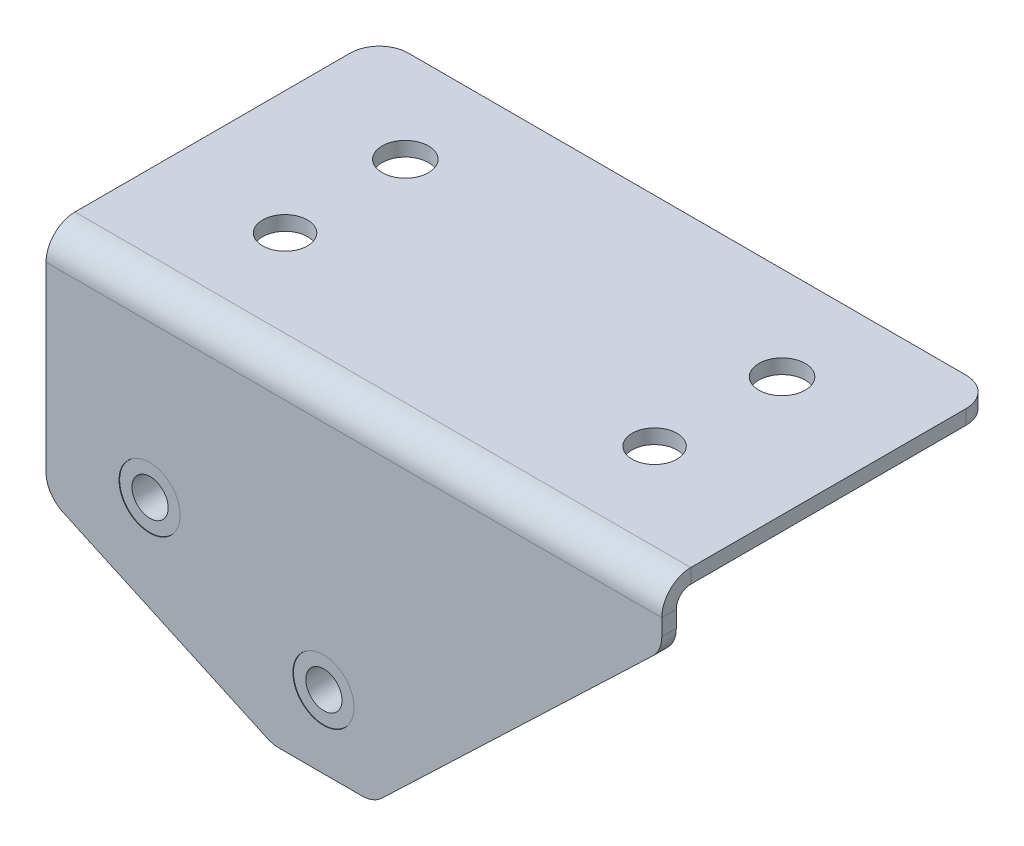
ISO-10303-21;
HEADER;
FILE_DESCRIPTION(('STEP AP214'),'2;1');
FILE_NAME('part.step','',(''),(''),'','','');
FILE_SCHEMA(('AUTOMOTIVE_DESIGN { 1 0 10303 214 1 1 1 1 }'));
ENDSEC;
DATA;
#1=APPLICATION_CONTEXT('core data for automotive mechanical design processes');
#2=APPLICATION_PROTOCOL_DEFINITION('international standard','automotive_design',2000,#1);
#3=PRODUCT_CONTEXT('',#1,'mechanical');
#4=PRODUCT('Part','Part','',(#3));
#5=PRODUCT_RELATED_PRODUCT_CATEGORY('part','',(#4));
#6=PRODUCT_DEFINITION_FORMATION('','',#4);
#7=PRODUCT_DEFINITION_CONTEXT('part definition',#1,'design');
#8=PRODUCT_DEFINITION('design','',#6,#7);
#9=PRODUCT_DEFINITION_SHAPE('','',#8);
#10=(LENGTH_UNIT() NAMED_UNIT(*) SI_UNIT(.MILLI.,.METRE.));
#11=(NAMED_UNIT(*) PLANE_ANGLE_UNIT() SI_UNIT($,.RADIAN.));
#12=(NAMED_UNIT(*) SI_UNIT($,.STERADIAN.) SOLID_ANGLE_UNIT());
#13=UNCERTAINTY_MEASURE_WITH_UNIT(LENGTH_MEASURE(1.E-05),#10,'distance_accuracy_value','');
#14=(GEOMETRIC_REPRESENTATION_CONTEXT(3) GLOBAL_UNCERTAINTY_ASSIGNED_CONTEXT((#13)) GLOBAL_UNIT_ASSIGNED_CONTEXT((#10,
#11,#12)) REPRESENTATION_CONTEXT('',''));
#15=CARTESIAN_POINT('',(0.,0.,0.));
#16=DIRECTION('',(0.,0.,1.));
#17=DIRECTION('',(1.,0.,0.));
#18=AXIS2_PLACEMENT_3D('',#15,#16,#17);
#19=CARTESIAN_POINT('',(7.14999999999999,10.5,-2.5));
#20=DIRECTION('',(0.,0.,1.));
#21=DIRECTION('',(1.,0.,0.));
#22=AXIS2_PLACEMENT_3D('',#19,#20,#21);
#23=PLANE('',#22);
#24=CARTESIAN_POINT('',(7.14999999999999,10.5,-2.5));
#25=DIRECTION('',(0.,0.,-1.));
#26=DIRECTION('',(0.,1.,0.));
#27=AXIS2_PLACEMENT_3D('',#24,#25,#26);
#28=CIRCLE('',#27,1.24999999999999);
#29=CARTESIAN_POINT('',(7.14999999999999,11.75,-2.5));
#30=VERTEX_POINT('',#29);
#31=EDGE_CURVE('E70',#30,#30,#28,.T.);
#32=ORIENTED_EDGE('',*,*,#31,.F.);
#33=EDGE_LOOP('',(#32));
#34=FACE_BOUND('',#33,.T.);
#35=CARTESIAN_POINT('',(7.14999999999999,10.5,-2.5));
#36=DIRECTION('',(0.,0.,-1.));
#37=DIRECTION('',(-1.,0.,0.));
#38=AXIS2_PLACEMENT_3D('',#35,#36,#37);
#39=CIRCLE('',#38,3.15);
#40=CARTESIAN_POINT('',(3.99999999999999,10.5,-2.5));
#41=VERTEX_POINT('',#40);
#42=EDGE_CURVE('E11',#41,#41,#39,.T.);
#43=ORIENTED_EDGE('',*,*,#42,.T.);
#44=EDGE_LOOP('',(#43));
#45=FACE_BOUND('',#44,.T.);
#46=ADVANCED_FACE('F48',(#34,#45),#23,.F.);
#47=CARTESIAN_POINT('',(7.14999999999999,10.5,-2.5));
#48=DIRECTION('',(0.,0.,-1.));
#49=DIRECTION('',(-1.,0.,0.));
#50=AXIS2_PLACEMENT_3D('',#47,#48,#49);
#51=CYLINDRICAL_SURFACE('',#50,3.15);
#52=ORIENTED_EDGE('',*,*,#42,.F.);
#53=EDGE_LOOP('',(#52));
#54=FACE_BOUND('',#53,.T.);
#55=CARTESIAN_POINT('',(7.14999999999999,10.5,-1.));
#56=DIRECTION('',(0.,0.,-1.));
#57=DIRECTION('',(-1.,0.,0.));
#58=AXIS2_PLACEMENT_3D('',#55,#56,#57);
#59=CIRCLE('',#58,3.15);
#60=CARTESIAN_POINT('',(3.99999999999999,10.5,-1.));
#61=VERTEX_POINT('',#60);
#62=EDGE_CURVE('E54',#61,#61,#59,.T.);
#63=ORIENTED_EDGE('',*,*,#62,.T.);
#64=EDGE_LOOP('',(#63));
#65=FACE_BOUND('',#64,.T.);
#66=ADVANCED_FACE('F78',(#54,#65),#51,.T.);
#67=CARTESIAN_POINT('',(10.3,10.5,-1.));
#68=DIRECTION('',(0.,0.,-1.));
#69=DIRECTION('',(-1.,0.,0.));
#70=AXIS2_PLACEMENT_3D('',#67,#68,#69);
#71=PLANE('',#70);
#72=ORIENTED_EDGE('',*,*,#62,.F.);
#73=EDGE_LOOP('',(#72));
#74=FACE_BOUND('',#73,.T.);
#75=CARTESIAN_POINT('',(7.14999999999999,10.5,-1.));
#76=DIRECTION('',(0.,0.,-1.));
#77=DIRECTION('',(-1.,0.,0.));
#78=AXIS2_PLACEMENT_3D('',#75,#76,#77);
#79=CIRCLE('',#78,2.1);
#80=CARTESIAN_POINT('',(5.04999999999998,10.5,-1.));
#81=VERTEX_POINT('',#80);
#82=EDGE_CURVE('E58',#81,#81,#79,.T.);
#83=ORIENTED_EDGE('',*,*,#82,.T.);
#84=EDGE_LOOP('',(#83));
#85=FACE_BOUND('',#84,.T.);
#86=ADVANCED_FACE('F82',(#74,#85),#71,.F.);
#87=CARTESIAN_POINT('',(7.14999999999999,10.5,-2.5));
#88=DIRECTION('',(0.,0.,-1.));
#89=DIRECTION('',(-1.,0.,0.));
#90=AXIS2_PLACEMENT_3D('',#87,#88,#89);
#91=CYLINDRICAL_SURFACE('',#90,2.1);
#92=ORIENTED_EDGE('',*,*,#82,.F.);
#93=EDGE_LOOP('',(#92));
#94=FACE_BOUND('',#93,.T.);
#95=CARTESIAN_POINT('',(7.14999999999999,10.5,-0.0300000000000014));
#96=DIRECTION('',(0.,0.,-1.));
#97=DIRECTION('',(-1.,0.,0.));
#98=AXIS2_PLACEMENT_3D('',#95,#96,#97);
#99=CIRCLE('',#98,2.1);
#100=CARTESIAN_POINT('',(5.04999999999998,10.5,-0.0300000000000014));
#101=VERTEX_POINT('',#100);
#102=EDGE_CURVE('E62',#101,#101,#99,.T.);
#103=ORIENTED_EDGE('',*,*,#102,.T.);
#104=EDGE_LOOP('',(#103));
#105=FACE_BOUND('',#104,.T.);
#106=ADVANCED_FACE('F87',(#94,#105),#91,.T.);
#107=CARTESIAN_POINT('',(9.24999999999999,10.5,-0.0300000000000014));
#108=DIRECTION('',(0.,0.,-1.));
#109=DIRECTION('',(-1.,0.,0.));
#110=AXIS2_PLACEMENT_3D('',#107,#108,#109);
#111=PLANE('',#110);
#112=CARTESIAN_POINT('',(7.14999999999999,10.5,-0.0300000000000014));
#113=DIRECTION('',(0.,0.,-1.));
#114=DIRECTION('',(-1.,0.,0.));
#115=AXIS2_PLACEMENT_3D('',#112,#113,#114);
#116=CIRCLE('',#115,1.24999999999999);
#117=CARTESIAN_POINT('',(5.9,10.5,-0.0300000000000014));
#118=VERTEX_POINT('',#117);
#119=EDGE_CURVE('E67',#118,#118,#116,.T.);
#120=ORIENTED_EDGE('',*,*,#119,.T.);
#121=EDGE_LOOP('',(#120));
#122=FACE_BOUND('',#121,.T.);
#123=ORIENTED_EDGE('',*,*,#102,.F.);
#124=EDGE_LOOP('',(#123));
#125=FACE_BOUND('',#124,.T.);
#126=ADVANCED_FACE('F93',(#122,#125),#111,.F.);
#127=CARTESIAN_POINT('',(7.14999999999999,10.5,-2.5));
#128=DIRECTION('',(0.,0.,-1.));
#129=DIRECTION('',(0.,1.,0.));
#130=AXIS2_PLACEMENT_3D('',#127,#128,#129);
#131=CYLINDRICAL_SURFACE('',#130,1.24999999999999);
#132=ORIENTED_EDGE('',*,*,#31,.T.);
#133=EDGE_LOOP('',(#132));
#134=FACE_BOUND('',#133,.T.);
#135=ORIENTED_EDGE('',*,*,#119,.F.);
#136=EDGE_LOOP('',(#135));
#137=FACE_BOUND('',#136,.T.);
#138=ADVANCED_FACE('F74',(#134,#137),#131,.F.);
#139=CLOSED_SHELL('',(#46,#66,#86,#106,#126,#138));
#140=MANIFOLD_SOLID_BREP('B2',#139);
#141=CARTESIAN_POINT('',(19.15,5.,-2.5));
#142=DIRECTION('',(0.,0.,1.));
#143=DIRECTION('',(1.,0.,0.));
#144=AXIS2_PLACEMENT_3D('',#141,#142,#143);
#145=PLANE('',#144);
#146=CARTESIAN_POINT('',(19.15,5.,-2.5));
#147=DIRECTION('',(0.,0.,-1.));
#148=DIRECTION('',(0.,1.,0.));
#149=AXIS2_PLACEMENT_3D('',#146,#147,#148);
#150=CIRCLE('',#149,1.24999999999999);
#151=CARTESIAN_POINT('',(19.15,6.24999999999999,-2.5));
#152=VERTEX_POINT('',#151);
#153=EDGE_CURVE('E185',#152,#152,#150,.T.);
#154=ORIENTED_EDGE('',*,*,#153,.F.);
#155=EDGE_LOOP('',(#154));
#156=FACE_BOUND('',#155,.T.);
#157=CARTESIAN_POINT('',(19.15,5.,-2.5));
#158=DIRECTION('',(0.,0.,-1.));
#159=DIRECTION('',(-1.,0.,0.));
#160=AXIS2_PLACEMENT_3D('',#157,#158,#159);
#161=CIRCLE('',#160,3.15);
#162=CARTESIAN_POINT('',(16.,5.,-2.5));
#163=VERTEX_POINT('',#162);
#164=EDGE_CURVE('E47',#163,#163,#161,.T.);
#165=ORIENTED_EDGE('',*,*,#164,.T.);
#166=EDGE_LOOP('',(#165));
#167=FACE_BOUND('',#166,.T.);
#168=ADVANCED_FACE('F163',(#156,#167),#145,.F.);
#169=CARTESIAN_POINT('',(19.15,5.,-2.5));
#170=DIRECTION('',(0.,0.,-1.));
#171=DIRECTION('',(-1.,0.,0.));
#172=AXIS2_PLACEMENT_3D('',#169,#170,#171);
#173=CYLINDRICAL_SURFACE('',#172,3.15);
#174=ORIENTED_EDGE('',*,*,#164,.F.);
#175=EDGE_LOOP('',(#174));
#176=FACE_BOUND('',#175,.T.);
#177=CARTESIAN_POINT('',(19.15,5.,-1.));
#178=DIRECTION('',(0.,0.,-1.));
#179=DIRECTION('',(-1.,0.,0.));
#180=AXIS2_PLACEMENT_3D('',#177,#178,#179);
#181=CIRCLE('',#180,3.15);
#182=CARTESIAN_POINT('',(16.,5.,-1.));
#183=VERTEX_POINT('',#182);
#184=EDGE_CURVE('E169',#183,#183,#181,.T.);
#185=ORIENTED_EDGE('',*,*,#184,.T.);
#186=EDGE_LOOP('',(#185));
#187=FACE_BOUND('',#186,.T.);
#188=ADVANCED_FACE('F193',(#176,#187),#173,.T.);
#189=CARTESIAN_POINT('',(22.3,5.,-1.));
#190=DIRECTION('',(0.,0.,-1.));
#191=DIRECTION('',(-1.,0.,0.));
#192=AXIS2_PLACEMENT_3D('',#189,#190,#191);
#193=PLANE('',#192);
#194=ORIENTED_EDGE('',*,*,#184,.F.);
#195=EDGE_LOOP('',(#194));
#196=FACE_BOUND('',#195,.T.);
#197=CARTESIAN_POINT('',(19.15,5.,-1.));
#198=DIRECTION('',(0.,0.,-1.));
#199=DIRECTION('',(-1.,0.,0.));
#200=AXIS2_PLACEMENT_3D('',#197,#198,#199);
#201=CIRCLE('',#200,2.1);
#202=CARTESIAN_POINT('',(17.05,5.,-1.));
#203=VERTEX_POINT('',#202);
#204=EDGE_CURVE('E173',#203,#203,#201,.T.);
#205=ORIENTED_EDGE('',*,*,#204,.T.);
#206=EDGE_LOOP('',(#205));
#207=FACE_BOUND('',#206,.T.);
#208=ADVANCED_FACE('F197',(#196,#207),#193,.F.);
#209=CARTESIAN_POINT('',(19.15,5.,-2.5));
#210=DIRECTION('',(0.,0.,-1.));
#211=DIRECTION('',(-1.,0.,0.));
#212=AXIS2_PLACEMENT_3D('',#209,#210,#211);
#213=CYLINDRICAL_SURFACE('',#212,2.1);
#214=ORIENTED_EDGE('',*,*,#204,.F.);
#215=EDGE_LOOP('',(#214));
#216=FACE_BOUND('',#215,.T.);
#217=CARTESIAN_POINT('',(19.15,5.,-0.0300000000000018));
#218=DIRECTION('',(0.,0.,-1.));
#219=DIRECTION('',(-1.,0.,0.));
#220=AXIS2_PLACEMENT_3D('',#217,#218,#219);
#221=CIRCLE('',#220,2.1);
#222=CARTESIAN_POINT('',(17.05,5.,-0.0300000000000018));
#223=VERTEX_POINT('',#222);
#224=EDGE_CURVE('E177',#223,#223,#221,.T.);
#225=ORIENTED_EDGE('',*,*,#224,.T.);
#226=EDGE_LOOP('',(#225));
#227=FACE_BOUND('',#226,.T.);
#228=ADVANCED_FACE('F202',(#216,#227),#213,.T.);
#229=CARTESIAN_POINT('',(21.25,5.,-0.0300000000000016));
#230=DIRECTION('',(0.,0.,-1.));
#231=DIRECTION('',(-1.,0.,0.));
#232=AXIS2_PLACEMENT_3D('',#229,#230,#231);
#233=PLANE('',#232);
#234=CARTESIAN_POINT('',(19.15,5.,-0.0300000000000018));
#235=DIRECTION('',(0.,0.,-1.));
#236=DIRECTION('',(-1.,0.,0.));
#237=AXIS2_PLACEMENT_3D('',#234,#235,#236);
#238=CIRCLE('',#237,1.24999999999999);
#239=CARTESIAN_POINT('',(17.9,5.,-0.0300000000000018));
#240=VERTEX_POINT('',#239);
#241=EDGE_CURVE('E182',#240,#240,#238,.T.);
#242=ORIENTED_EDGE('',*,*,#241,.T.);
#243=EDGE_LOOP('',(#242));
#244=FACE_BOUND('',#243,.T.);
#245=ORIENTED_EDGE('',*,*,#224,.F.);
#246=EDGE_LOOP('',(#245));
#247=FACE_BOUND('',#246,.T.);
#248=ADVANCED_FACE('F208',(#244,#247),#233,.F.);
#249=CARTESIAN_POINT('',(19.15,5.,-2.5));
#250=DIRECTION('',(0.,0.,-1.));
#251=DIRECTION('',(0.,1.,0.));
#252=AXIS2_PLACEMENT_3D('',#249,#250,#251);
#253=CYLINDRICAL_SURFACE('',#252,1.24999999999999);
#254=ORIENTED_EDGE('',*,*,#153,.T.);
#255=EDGE_LOOP('',(#254));
#256=FACE_BOUND('',#255,.T.);
#257=ORIENTED_EDGE('',*,*,#241,.F.);
#258=EDGE_LOOP('',(#257));
#259=FACE_BOUND('',#258,.T.);
#260=ADVANCED_FACE('F189',(#256,#259),#253,.F.);
#261=CLOSED_SHELL('',(#168,#188,#208,#228,#248,#260));
#262=MANIFOLD_SOLID_BREP('B6',#261);
#263=CARTESIAN_POINT('',(0.,0.,-1.));
#264=DIRECTION('',(0.,0.,-1.));
#265=DIRECTION('',(-1.,0.,0.));
#266=AXIS2_PLACEMENT_3D('',#263,#264,#265);
#267=PLANE('',#266);
#268=CARTESIAN_POINT('',(19.15,5.,-1.));
#269=DIRECTION('',(0.,0.,1.));
#270=DIRECTION('',(1.,0.,0.));
#271=AXIS2_PLACEMENT_3D('',#268,#269,#270);
#272=CIRCLE('',#271,2.11);
#273=CARTESIAN_POINT('',(21.26,5.,-1.));
#274=VERTEX_POINT('',#273);
#275=EDGE_CURVE('E528',#274,#274,#272,.T.);
#276=ORIENTED_EDGE('',*,*,#275,.T.);
#277=EDGE_LOOP('',(#276));
#278=FACE_BOUND('',#277,.T.);
#279=CARTESIAN_POINT('',(7.14999999999999,10.5,-1.));
#280=DIRECTION('',(0.,0.,1.));
#281=DIRECTION('',(1.,0.,0.));
#282=AXIS2_PLACEMENT_3D('',#279,#280,#281);
#283=CIRCLE('',#282,2.11);
#284=CARTESIAN_POINT('',(9.25999999999999,10.5,-1.));
#285=VERTEX_POINT('',#284);
#286=EDGE_CURVE('E523',#285,#285,#283,.T.);
#287=ORIENTED_EDGE('',*,*,#286,.T.);
#288=EDGE_LOOP('',(#287));
#289=FACE_BOUND('',#288,.T.);
#290=DIRECTION('',(0.,1.,0.));
#291=VECTOR('',#290,1.);
#292=CARTESIAN_POINT('',(42.5,0.,-1.));
#293=LINE('',#292,#291);
#294=CARTESIAN_POINT('',(42.5,19.8556065200386,-1.));
#295=VERTEX_POINT('',#294);
#296=CARTESIAN_POINT('',(42.5,21.,-1.));
#297=VERTEX_POINT('',#296);
#298=EDGE_CURVE('E448',#295,#297,#293,.T.);
#299=ORIENTED_EDGE('',*,*,#298,.F.);
#300=CARTESIAN_POINT('',(40.5,19.8556065200386,-1.));
#301=DIRECTION('',(0.,0.,-1.));
#302=DIRECTION('',(-1.,0.,0.));
#303=AXIS2_PLACEMENT_3D('',#300,#301,#302);
#304=CIRCLE('',#303,2.);
#305=CARTESIAN_POINT('',(41.8811894796554,18.4091226378991,-1.));
#306=VERTEX_POINT('',#305);
#307=EDGE_CURVE('E477',#295,#306,#304,.T.);
#308=ORIENTED_EDGE('',*,*,#307,.T.);
#309=DIRECTION('',(0.723241941069744,0.690594739827686,0.));
#310=VECTOR('',#309,1.);
#311=CARTESIAN_POINT('',(10.7792720014158,-11.2888517042107,-1.));
#312=LINE('',#311,#310);
#313=CARTESIAN_POINT('',(23.1814763573797,0.553516117860515,-1.));
#314=VERTEX_POINT('',#313);
#315=EDGE_CURVE('E537',#314,#306,#312,.T.);
#316=ORIENTED_EDGE('',*,*,#315,.F.);
#317=CARTESIAN_POINT('',(21.8002868777243,2.,-1.));
#318=DIRECTION('',(0.,0.,-1.));
#319=DIRECTION('',(-1.,0.,0.));
#320=AXIS2_PLACEMENT_3D('',#317,#318,#319);
#321=CIRCLE('',#320,2.);
#322=CARTESIAN_POINT('',(21.8002868777243,0.,-1.));
#323=VERTEX_POINT('',#322);
#324=EDGE_CURVE('E475',#314,#323,#321,.T.);
#325=ORIENTED_EDGE('',*,*,#324,.T.);
#326=DIRECTION('',(1.,0.,0.));
#327=VECTOR('',#326,1.);
#328=CARTESIAN_POINT('',(0.,0.,-1.));
#329=LINE('',#328,#327);
#330=CARTESIAN_POINT('',(16.0951790673134,0.,-1.));
#331=VERTEX_POINT('',#330);
#332=EDGE_CURVE('E444',#331,#323,#329,.T.);
#333=ORIENTED_EDGE('',*,*,#332,.F.);
#334=CARTESIAN_POINT('',(16.0951790673134,2.,-1.));
#335=DIRECTION('',(0.,0.,-1.));
#336=DIRECTION('',(-1.,0.,0.));
#337=AXIS2_PLACEMENT_3D('',#334,#335,#336);
#338=CIRCLE('',#337,2.);
#339=CARTESIAN_POINT('',(15.261869646327,0.18187035421143,-1.));
#340=VERTEX_POINT('',#339);
#341=EDGE_CURVE('E473',#331,#340,#338,.T.);
#342=ORIENTED_EDGE('',*,*,#341,.T.);
#343=DIRECTION('',(0.909064822894284,-0.416654710493214,0.));
#344=VECTOR('',#343,1.);
#345=CARTESIAN_POINT('',(2.71836441996754,5.93097691629283,-1.));
#346=LINE('',#345,#344);
#347=CARTESIAN_POINT('',(1.16669057901357,6.6421607600634,-1.));
#348=VERTEX_POINT('',#347);
#349=EDGE_CURVE('E543',#348,#340,#346,.T.);
#350=ORIENTED_EDGE('',*,*,#349,.F.);
#351=CARTESIAN_POINT('',(1.99999999999999,8.46029040585197,-1.));
#352=DIRECTION('',(0.,0.,-1.));
#353=DIRECTION('',(-1.,0.,0.));
#354=AXIS2_PLACEMENT_3D('',#351,#352,#353);
#355=CIRCLE('',#354,2.);
#356=CARTESIAN_POINT('',(0.,8.46029040585197,-1.));
#357=VERTEX_POINT('',#356);
#358=EDGE_CURVE('E471',#348,#357,#355,.T.);
#359=ORIENTED_EDGE('',*,*,#358,.T.);
#360=DIRECTION('',(0.,-1.,0.));
#361=VECTOR('',#360,1.);
#362=CARTESIAN_POINT('',(0.,0.,-1.));
#363=LINE('',#362,#361);
#364=CARTESIAN_POINT('',(0.,21.,-1.));
#365=VERTEX_POINT('',#364);
#366=EDGE_CURVE('E441',#365,#357,#363,.T.);
#367=ORIENTED_EDGE('',*,*,#366,.F.);
#368=DIRECTION('',(1.,0.,0.));
#369=VECTOR('',#368,1.);
#370=CARTESIAN_POINT('',(42.5,21.,-1.));
#371=LINE('',#370,#369);
#372=EDGE_CURVE('E431',#297,#365,#371,.F.);
#373=ORIENTED_EDGE('',*,*,#372,.F.);
#374=EDGE_LOOP('',(#299,#308,#316,#325,#333,#342,#350,#359,#367,#373));
#375=FACE_BOUND('',#374,.T.);
#376=ADVANCED_FACE('F268',(#278,#289,#375),#267,.T.);
#377=CARTESIAN_POINT('',(0.,0.,0.));
#378=DIRECTION('',(0.,0.,-1.));
#379=DIRECTION('',(-1.,0.,0.));
#380=AXIS2_PLACEMENT_3D('',#377,#378,#379);
#381=PLANE('',#380);
#382=CARTESIAN_POINT('',(19.15,5.,0.));
#383=DIRECTION('',(0.,0.,1.));
#384=DIRECTION('',(1.,0.,0.));
#385=AXIS2_PLACEMENT_3D('',#382,#383,#384);
#386=CIRCLE('',#385,2.11);
#387=CARTESIAN_POINT('',(21.26,5.,0.));
#388=VERTEX_POINT('',#387);
#389=EDGE_CURVE('E531',#388,#388,#386,.T.);
#390=ORIENTED_EDGE('',*,*,#389,.F.);
#391=EDGE_LOOP('',(#390));
#392=FACE_BOUND('',#391,.T.);
#393=CARTESIAN_POINT('',(7.14999999999999,10.5,0.));
#394=DIRECTION('',(0.,0.,1.));
#395=DIRECTION('',(1.,0.,0.));
#396=AXIS2_PLACEMENT_3D('',#393,#394,#395);
#397=CIRCLE('',#396,2.11);
#398=CARTESIAN_POINT('',(9.25999999999999,10.5,0.));
#399=VERTEX_POINT('',#398);
#400=EDGE_CURVE('E525',#399,#399,#397,.T.);
#401=ORIENTED_EDGE('',*,*,#400,.F.);
#402=EDGE_LOOP('',(#401));
#403=FACE_BOUND('',#402,.T.);
#404=DIRECTION('',(0.723241941069744,0.690594739827686,0.));
#405=VECTOR('',#404,1.);
#406=CARTESIAN_POINT('',(10.7792720014158,-11.2888517042107,0.));
#407=LINE('',#406,#405);
#408=CARTESIAN_POINT('',(23.1814763573797,0.553516117860515,0.));
#409=VERTEX_POINT('',#408);
#410=CARTESIAN_POINT('',(41.8811894796554,18.4091226378991,0.));
#411=VERTEX_POINT('',#410);
#412=EDGE_CURVE('E534',#409,#411,#407,.T.);
#413=ORIENTED_EDGE('',*,*,#412,.T.);
#414=CARTESIAN_POINT('',(40.5,19.8556065200386,0.));
#415=DIRECTION('',(0.,0.,-1.));
#416=DIRECTION('',(-1.,0.,0.));
#417=AXIS2_PLACEMENT_3D('',#414,#415,#416);
#418=CIRCLE('',#417,2.);
#419=CARTESIAN_POINT('',(42.5,19.8556065200386,0.));
#420=VERTEX_POINT('',#419);
#421=EDGE_CURVE('E467',#411,#420,#418,.F.);
#422=ORIENTED_EDGE('',*,*,#421,.T.);
#423=DIRECTION('',(0.,1.,0.));
#424=VECTOR('',#423,1.);
#425=CARTESIAN_POINT('',(42.5,0.,0.));
#426=LINE('',#425,#424);
#427=CARTESIAN_POINT('',(42.5,21.,0.));
#428=VERTEX_POINT('',#427);
#429=EDGE_CURVE('E445',#420,#428,#426,.T.);
#430=ORIENTED_EDGE('',*,*,#429,.T.);
#431=DIRECTION('',(1.,0.,0.));
#432=VECTOR('',#431,1.);
#433=CARTESIAN_POINT('',(42.5,21.,0.));
#434=LINE('',#433,#432);
#435=CARTESIAN_POINT('',(0.,21.,0.));
#436=VERTEX_POINT('',#435);
#437=EDGE_CURVE('E391',#428,#436,#434,.F.);
#438=ORIENTED_EDGE('',*,*,#437,.T.);
#439=DIRECTION('',(0.,-1.,0.));
#440=VECTOR('',#439,1.);
#441=CARTESIAN_POINT('',(0.,0.,0.));
#442=LINE('',#441,#440);
#443=CARTESIAN_POINT('',(0.,8.46029040585197,0.));
#444=VERTEX_POINT('',#443);
#445=EDGE_CURVE('E438',#436,#444,#442,.T.);
#446=ORIENTED_EDGE('',*,*,#445,.T.);
#447=CARTESIAN_POINT('',(1.99999999999999,8.46029040585197,0.));
#448=DIRECTION('',(0.,0.,-1.));
#449=DIRECTION('',(-1.,0.,0.));
#450=AXIS2_PLACEMENT_3D('',#447,#448,#449);
#451=CIRCLE('',#450,2.);
#452=CARTESIAN_POINT('',(1.16669057901357,6.6421607600634,0.));
#453=VERTEX_POINT('',#452);
#454=EDGE_CURVE('E461',#444,#453,#451,.F.);
#455=ORIENTED_EDGE('',*,*,#454,.T.);
#456=DIRECTION('',(0.909064822894284,-0.416654710493214,0.));
#457=VECTOR('',#456,1.);
#458=CARTESIAN_POINT('',(2.71836441996754,5.93097691629283,0.));
#459=LINE('',#458,#457);
#460=CARTESIAN_POINT('',(15.261869646327,0.18187035421143,0.));
#461=VERTEX_POINT('',#460);
#462=EDGE_CURVE('E540',#453,#461,#459,.T.);
#463=ORIENTED_EDGE('',*,*,#462,.T.);
#464=CARTESIAN_POINT('',(16.0951790673134,2.,0.));
#465=DIRECTION('',(0.,0.,-1.));
#466=DIRECTION('',(-1.,0.,0.));
#467=AXIS2_PLACEMENT_3D('',#464,#465,#466);
#468=CIRCLE('',#467,2.);
#469=CARTESIAN_POINT('',(16.0951790673134,0.,0.));
#470=VERTEX_POINT('',#469);
#471=EDGE_CURVE('E463',#461,#470,#468,.F.);
#472=ORIENTED_EDGE('',*,*,#471,.T.);
#473=DIRECTION('',(1.,0.,0.));
#474=VECTOR('',#473,1.);
#475=CARTESIAN_POINT('',(0.,0.,0.));
#476=LINE('',#475,#474);
#477=CARTESIAN_POINT('',(21.8002868777243,0.,0.));
#478=VERTEX_POINT('',#477);
#479=EDGE_CURVE('E453',#470,#478,#476,.T.);
#480=ORIENTED_EDGE('',*,*,#479,.T.);
#481=CARTESIAN_POINT('',(21.8002868777243,2.,0.));
#482=DIRECTION('',(0.,0.,-1.));
#483=DIRECTION('',(-1.,0.,0.));
#484=AXIS2_PLACEMENT_3D('',#481,#482,#483);
#485=CIRCLE('',#484,2.);
#486=EDGE_CURVE('E465',#478,#409,#485,.F.);
#487=ORIENTED_EDGE('',*,*,#486,.T.);
#488=EDGE_LOOP('',(#413,#422,#430,#438,#446,#455,#463,#472,#480,#487));
#489=FACE_BOUND('',#488,.T.);
#490=ADVANCED_FACE('F605',(#392,#403,#489),#381,.F.);
#491=CARTESIAN_POINT('',(0.,0.,-1.));
#492=DIRECTION('',(0.,-1.,0.));
#493=DIRECTION('',(0.,0.,-1.));
#494=AXIS2_PLACEMENT_3D('',#491,#492,#493);
#495=PLANE('',#494);
#496=ORIENTED_EDGE('',*,*,#332,.T.);
#497=DIRECTION('',(0.,0.,-1.));
#498=VECTOR('',#497,1.);
#499=CARTESIAN_POINT('',(21.8002868777243,0.,-1.));
#500=LINE('',#499,#498);
#501=EDGE_CURVE('E481',#323,#478,#500,.F.);
#502=ORIENTED_EDGE('',*,*,#501,.T.);
#503=ORIENTED_EDGE('',*,*,#479,.F.);
#504=DIRECTION('',(0.,0.,-1.));
#505=VECTOR('',#504,1.);
#506=CARTESIAN_POINT('',(16.0951790673134,0.,-1.));
#507=LINE('',#506,#505);
#508=EDGE_CURVE('E479',#470,#331,#507,.T.);
#509=ORIENTED_EDGE('',*,*,#508,.T.);
#510=EDGE_LOOP('',(#496,#502,#503,#509));
#511=FACE_BOUND('',#510,.T.);
#512=ADVANCED_FACE('F611',(#511),#495,.T.);
#513=CARTESIAN_POINT('',(0.,0.,-1.));
#514=DIRECTION('',(-1.,0.,0.));
#515=DIRECTION('',(0.,-1.,0.));
#516=AXIS2_PLACEMENT_3D('',#513,#514,#515);
#517=PLANE('',#516);
#518=ORIENTED_EDGE('',*,*,#366,.T.);
#519=DIRECTION('',(0.,0.,-1.));
#520=VECTOR('',#519,1.);
#521=CARTESIAN_POINT('',(0.,8.46029040585197,-1.));
#522=LINE('',#521,#520);
#523=EDGE_CURVE('E489',#357,#444,#522,.F.);
#524=ORIENTED_EDGE('',*,*,#523,.T.);
#525=ORIENTED_EDGE('',*,*,#445,.F.);
#526=DIRECTION('',(0.,0.,1.));
#527=VECTOR('',#526,1.);
#528=CARTESIAN_POINT('',(0.,21.,-1.));
#529=LINE('',#528,#527);
#530=EDGE_CURVE('E435',#365,#436,#529,.T.);
#531=ORIENTED_EDGE('',*,*,#530,.F.);
#532=EDGE_LOOP('',(#518,#524,#525,#531));
#533=FACE_BOUND('',#532,.T.);
#534=ADVANCED_FACE('F622',(#533),#517,.T.);
#535=CARTESIAN_POINT('',(42.5,0.,-1.));
#536=DIRECTION('',(1.,0.,0.));
#537=DIRECTION('',(0.,0.,-1.));
#538=AXIS2_PLACEMENT_3D('',#535,#536,#537);
#539=PLANE('',#538);
#540=ORIENTED_EDGE('',*,*,#429,.F.);
#541=DIRECTION('',(0.,0.,-1.));
#542=VECTOR('',#541,1.);
#543=CARTESIAN_POINT('',(42.5,19.8556065200386,-1.));
#544=LINE('',#543,#542);
#545=EDGE_CURVE('E469',#420,#295,#544,.T.);
#546=ORIENTED_EDGE('',*,*,#545,.T.);
#547=ORIENTED_EDGE('',*,*,#298,.T.);
#548=DIRECTION('',(0.,0.,1.));
#549=VECTOR('',#548,1.);
#550=CARTESIAN_POINT('',(42.5,21.,-1.));
#551=LINE('',#550,#549);
#552=EDGE_CURVE('E427',#297,#428,#551,.T.);
#553=ORIENTED_EDGE('',*,*,#552,.T.);
#554=EDGE_LOOP('',(#540,#546,#547,#553));
#555=FACE_BOUND('',#554,.T.);
#556=ADVANCED_FACE('F618',(#555),#539,.T.);
#557=CARTESIAN_POINT('',(0.,21.,-2.));
#558=DIRECTION('',(-1.,0.,0.));
#559=DIRECTION('',(0.,0.,1.));
#560=AXIS2_PLACEMENT_3D('',#557,#558,#559);
#561=PLANE('',#560);
#562=DIRECTION('',(0.,1.,0.));
#563=VECTOR('',#562,1.);
#564=CARTESIAN_POINT('',(0.,22.,-2.));
#565=LINE('',#564,#563);
#566=CARTESIAN_POINT('',(0.,22.,-2.));
#567=VERTEX_POINT('',#566);
#568=CARTESIAN_POINT('',(0.,23.,-1.99999999999999));
#569=VERTEX_POINT('',#568);
#570=EDGE_CURVE('E512',#567,#569,#565,.T.);
#571=ORIENTED_EDGE('',*,*,#570,.F.);
#572=CARTESIAN_POINT('',(0.,21.,-2.));
#573=DIRECTION('',(1.,0.,0.));
#574=DIRECTION('',(0.,0.,-1.));
#575=AXIS2_PLACEMENT_3D('',#572,#573,#574);
#576=CIRCLE('',#575,1.);
#577=EDGE_CURVE('E394',#365,#567,#576,.F.);
#578=ORIENTED_EDGE('',*,*,#577,.F.);
#579=ORIENTED_EDGE('',*,*,#530,.T.);
#580=CARTESIAN_POINT('',(0.,21.,-2.));
#581=DIRECTION('',(1.,0.,0.));
#582=DIRECTION('',(0.,0.,-1.));
#583=AXIS2_PLACEMENT_3D('',#580,#581,#582);
#584=CIRCLE('',#583,2.);
#585=EDGE_CURVE('E426',#436,#569,#584,.F.);
#586=ORIENTED_EDGE('',*,*,#585,.T.);
#587=EDGE_LOOP('',(#571,#578,#579,#586));
#588=FACE_BOUND('',#587,.T.);
#589=ADVANCED_FACE('F621',(#588),#561,.T.);
#590=CARTESIAN_POINT('',(42.5,21.,-2.));
#591=DIRECTION('',(-1.,0.,0.));
#592=DIRECTION('',(0.,0.,1.));
#593=AXIS2_PLACEMENT_3D('',#590,#591,#592);
#594=PLANE('',#593);
#595=CARTESIAN_POINT('',(42.5,21.,-2.));
#596=DIRECTION('',(1.,0.,0.));
#597=DIRECTION('',(0.,0.,-1.));
#598=AXIS2_PLACEMENT_3D('',#595,#596,#597);
#599=CIRCLE('',#598,1.);
#600=CARTESIAN_POINT('',(42.5,22.,-2.));
#601=VERTEX_POINT('',#600);
#602=EDGE_CURVE('E401',#601,#297,#599,.T.);
#603=ORIENTED_EDGE('',*,*,#602,.F.);
#604=DIRECTION('',(0.,1.,0.));
#605=VECTOR('',#604,1.);
#606=CARTESIAN_POINT('',(42.5,22.,-2.));
#607=LINE('',#606,#605);
#608=CARTESIAN_POINT('',(42.5,23.,-1.99999999999999));
#609=VERTEX_POINT('',#608);
#610=EDGE_CURVE('E398',#601,#609,#607,.T.);
#611=ORIENTED_EDGE('',*,*,#610,.T.);
#612=CARTESIAN_POINT('',(42.5,21.,-2.));
#613=DIRECTION('',(1.,0.,0.));
#614=DIRECTION('',(0.,0.,-1.));
#615=AXIS2_PLACEMENT_3D('',#612,#613,#614);
#616=CIRCLE('',#615,2.);
#617=EDGE_CURVE('E384',#609,#428,#616,.T.);
#618=ORIENTED_EDGE('',*,*,#617,.T.);
#619=ORIENTED_EDGE('',*,*,#552,.F.);
#620=EDGE_LOOP('',(#603,#611,#618,#619));
#621=FACE_BOUND('',#620,.T.);
#622=ADVANCED_FACE('F399',(#621),#594,.F.);
#623=CARTESIAN_POINT('',(42.5,21.,-2.));
#624=DIRECTION('',(1.,0.,0.));
#625=DIRECTION('',(0.,1.,0.));
#626=AXIS2_PLACEMENT_3D('',#623,#624,#625);
#627=CYLINDRICAL_SURFACE('',#626,2.);
#628=ORIENTED_EDGE('',*,*,#437,.F.);
#629=ORIENTED_EDGE('',*,*,#617,.F.);
#630=DIRECTION('',(-1.,0.,0.));
#631=VECTOR('',#630,1.);
#632=CARTESIAN_POINT('',(0.,23.,-1.99999999999999));
#633=LINE('',#632,#631);
#634=EDGE_CURVE('E389',#609,#569,#633,.T.);
#635=ORIENTED_EDGE('',*,*,#634,.T.);
#636=ORIENTED_EDGE('',*,*,#585,.F.);
#637=EDGE_LOOP('',(#628,#629,#635,#636));
#638=FACE_BOUND('',#637,.T.);
#639=ADVANCED_FACE('F386',(#638),#627,.T.);
#640=CARTESIAN_POINT('',(42.5,21.,-2.));
#641=DIRECTION('',(1.,0.,0.));
#642=DIRECTION('',(0.,1.,0.));
#643=AXIS2_PLACEMENT_3D('',#640,#641,#642);
#644=CYLINDRICAL_SURFACE('',#643,1.);
#645=ORIENTED_EDGE('',*,*,#372,.T.);
#646=ORIENTED_EDGE('',*,*,#577,.T.);
#647=DIRECTION('',(1.,0.,0.));
#648=VECTOR('',#647,1.);
#649=CARTESIAN_POINT('',(0.,22.,-2.));
#650=LINE('',#649,#648);
#651=EDGE_CURVE('E403',#567,#601,#650,.T.);
#652=ORIENTED_EDGE('',*,*,#651,.T.);
#653=ORIENTED_EDGE('',*,*,#602,.T.);
#654=EDGE_LOOP('',(#645,#646,#652,#653));
#655=FACE_BOUND('',#654,.T.);
#656=ADVANCED_FACE('F802',(#655),#644,.F.);
#657=CARTESIAN_POINT('',(42.5,23.0000000000001,-23.));
#658=DIRECTION('',(-1.,0.,0.));
#659=DIRECTION('',(0.,0.,1.));
#660=AXIS2_PLACEMENT_3D('',#657,#658,#659);
#661=PLANE('',#660);
#662=DIRECTION('',(0.,0.,-1.));
#663=VECTOR('',#662,1.);
#664=CARTESIAN_POINT('',(42.5,22.0000000000001,-23.));
#665=LINE('',#664,#663);
#666=CARTESIAN_POINT('',(42.5,22.0000000000001,-21.));
#667=VERTEX_POINT('',#666);
#668=EDGE_CURVE('E411',#601,#667,#665,.T.);
#669=ORIENTED_EDGE('',*,*,#668,.T.);
#670=DIRECTION('',(0.,-1.,0.));
#671=VECTOR('',#670,1.);
#672=CARTESIAN_POINT('',(42.5,23.0000000000001,-21.));
#673=LINE('',#672,#671);
#674=CARTESIAN_POINT('',(42.5,23.0000000000001,-21.));
#675=VERTEX_POINT('',#674);
#676=EDGE_CURVE('E161',#667,#675,#673,.F.);
#677=ORIENTED_EDGE('',*,*,#676,.T.);
#678=DIRECTION('',(0.,0.,-1.));
#679=VECTOR('',#678,1.);
#680=CARTESIAN_POINT('',(42.5,23.0000000000001,-23.));
#681=LINE('',#680,#679);
#682=EDGE_CURVE('E407',#609,#675,#681,.T.);
#683=ORIENTED_EDGE('',*,*,#682,.F.);
#684=ORIENTED_EDGE('',*,*,#610,.F.);
#685=EDGE_LOOP('',(#669,#677,#683,#684));
#686=FACE_BOUND('',#685,.T.);
#687=ADVANCED_FACE('F413',(#686),#661,.F.);
#688=CARTESIAN_POINT('',(0.,23.,-0.999999999999997));
#689=DIRECTION('',(1.,0.,0.));
#690=DIRECTION('',(0.,0.,-1.));
#691=AXIS2_PLACEMENT_3D('',#688,#689,#690);
#692=PLANE('',#691);
#693=DIRECTION('',(0.,0.,1.));
#694=VECTOR('',#693,1.);
#695=CARTESIAN_POINT('',(0.,23.,-0.999999999999997));
#696=LINE('',#695,#694);
#697=CARTESIAN_POINT('',(0.,23.0000000000001,-21.));
#698=VERTEX_POINT('',#697);
#699=EDGE_CURVE('E410',#698,#569,#696,.T.);
#700=ORIENTED_EDGE('',*,*,#699,.F.);
#701=DIRECTION('',(0.,-1.,0.));
#702=VECTOR('',#701,1.);
#703=CARTESIAN_POINT('',(0.,23.0000000000001,-21.));
#704=LINE('',#703,#702);
#705=CARTESIAN_POINT('',(0.,22.0000000000001,-21.));
#706=VERTEX_POINT('',#705);
#707=EDGE_CURVE('E492',#698,#706,#704,.T.);
#708=ORIENTED_EDGE('',*,*,#707,.T.);
#709=DIRECTION('',(0.,0.,1.));
#710=VECTOR('',#709,1.);
#711=CARTESIAN_POINT('',(0.,22.,-1.));
#712=LINE('',#711,#710);
#713=EDGE_CURVE('E415',#706,#567,#712,.T.);
#714=ORIENTED_EDGE('',*,*,#713,.T.);
#715=ORIENTED_EDGE('',*,*,#570,.T.);
#716=EDGE_LOOP('',(#700,#708,#714,#715));
#717=FACE_BOUND('',#716,.T.);
#718=ADVANCED_FACE('F509',(#717),#692,.F.);
#719=CARTESIAN_POINT('',(0.,23.,0.));
#720=DIRECTION('',(0.,-1.,0.));
#721=DIRECTION('',(0.,0.,-1.));
#722=AXIS2_PLACEMENT_3D('',#719,#720,#721);
#723=PLANE('',#722);
#724=CARTESIAN_POINT('',(34.25,23.0000000000001,-16.55));
#725=DIRECTION('',(0.,1.,0.));
#726=DIRECTION('',(0.,0.,-1.));
#727=AXIS2_PLACEMENT_3D('',#724,#725,#726);
#728=CIRCLE('',#727,1.6);
#729=CARTESIAN_POINT('',(34.25,23.0000000000001,-18.15));
#730=VERTEX_POINT('',#729);
#731=EDGE_CURVE('E567',#730,#730,#728,.T.);
#732=ORIENTED_EDGE('',*,*,#731,.F.);
#733=EDGE_LOOP('',(#732));
#734=FACE_BOUND('',#733,.T.);
#735=CARTESIAN_POINT('',(34.,23.,-8.));
#736=DIRECTION('',(0.,1.,0.));
#737=DIRECTION('',(0.,0.,-1.));
#738=AXIS2_PLACEMENT_3D('',#735,#736,#737);
#739=CIRCLE('',#738,1.55);
#740=CARTESIAN_POINT('',(34.,23.,-9.55));
#741=VERTEX_POINT('',#740);
#742=EDGE_CURVE('E561',#741,#741,#739,.T.);
#743=ORIENTED_EDGE('',*,*,#742,.F.);
#744=EDGE_LOOP('',(#743));
#745=FACE_BOUND('',#744,.T.);
#746=CARTESIAN_POINT('',(8.49999999999999,23.,-8.));
#747=DIRECTION('',(0.,1.,0.));
#748=DIRECTION('',(0.,0.,1.));
#749=AXIS2_PLACEMENT_3D('',#746,#747,#748);
#750=CIRCLE('',#749,1.55);
#751=CARTESIAN_POINT('',(8.49999999999999,23.,-6.45));
#752=VERTEX_POINT('',#751);
#753=EDGE_CURVE('E555',#752,#752,#750,.T.);
#754=ORIENTED_EDGE('',*,*,#753,.F.);
#755=EDGE_LOOP('',(#754));
#756=FACE_BOUND('',#755,.T.);
#757=CARTESIAN_POINT('',(8.24999999999999,23.0000000000001,-16.55));
#758=DIRECTION('',(0.,1.,0.));
#759=DIRECTION('',(0.,0.,1.));
#760=AXIS2_PLACEMENT_3D('',#757,#758,#759);
#761=CIRCLE('',#760,1.6);
#762=CARTESIAN_POINT('',(8.24999999999999,23.,-14.95));
#763=VERTEX_POINT('',#762);
#764=EDGE_CURVE('E549',#763,#763,#761,.T.);
#765=ORIENTED_EDGE('',*,*,#764,.F.);
#766=EDGE_LOOP('',(#765));
#767=FACE_BOUND('',#766,.T.);
#768=DIRECTION('',(-1.,0.,0.));
#769=VECTOR('',#768,1.);
#770=CARTESIAN_POINT('',(0.,23.0000000000001,-23.));
#771=LINE('',#770,#769);
#772=CARTESIAN_POINT('',(40.5,23.0000000000001,-23.));
#773=VERTEX_POINT('',#772);
#774=CARTESIAN_POINT('',(1.99999999999999,23.0000000000001,-23.));
#775=VERTEX_POINT('',#774);
#776=EDGE_CURVE('E414',#773,#775,#771,.T.);
#777=ORIENTED_EDGE('',*,*,#776,.T.);
#778=CARTESIAN_POINT('',(1.99999999999999,23.0000000000001,-21.));
#779=DIRECTION('',(0.,-1.,0.));
#780=DIRECTION('',(0.,0.,-1.));
#781=AXIS2_PLACEMENT_3D('',#778,#779,#780);
#782=CIRCLE('',#781,2.);
#783=EDGE_CURVE('E276',#775,#698,#782,.F.);
#784=ORIENTED_EDGE('',*,*,#783,.T.);
#785=ORIENTED_EDGE('',*,*,#699,.T.);
#786=ORIENTED_EDGE('',*,*,#634,.F.);
#787=ORIENTED_EDGE('',*,*,#682,.T.);
#788=CARTESIAN_POINT('',(40.5,23.0000000000001,-21.));
#789=DIRECTION('',(0.,-1.,0.));
#790=DIRECTION('',(0.,0.,-1.));
#791=AXIS2_PLACEMENT_3D('',#788,#789,#790);
#792=CIRCLE('',#791,2.);
#793=EDGE_CURVE('E503',#675,#773,#792,.F.);
#794=ORIENTED_EDGE('',*,*,#793,.T.);
#795=EDGE_LOOP('',(#777,#784,#785,#786,#787,#794));
#796=FACE_BOUND('',#795,.T.);
#797=ADVANCED_FACE('F406',(#734,#745,#756,#767,#796),#723,.F.);
#798=CARTESIAN_POINT('',(0.,22.,0.));
#799=DIRECTION('',(0.,-1.,0.));
#800=DIRECTION('',(0.,0.,-1.));
#801=AXIS2_PLACEMENT_3D('',#798,#799,#800);
#802=PLANE('',#801);
#803=CARTESIAN_POINT('',(34.25,22.0000000000001,-16.55));
#804=DIRECTION('',(0.,1.,0.));
#805=DIRECTION('',(0.,0.,-1.));
#806=AXIS2_PLACEMENT_3D('',#803,#804,#805);
#807=CIRCLE('',#806,1.6);
#808=CARTESIAN_POINT('',(34.25,22.0000000000001,-18.15));
#809=VERTEX_POINT('',#808);
#810=EDGE_CURVE('E564',#809,#809,#807,.T.);
#811=ORIENTED_EDGE('',*,*,#810,.T.);
#812=EDGE_LOOP('',(#811));
#813=FACE_BOUND('',#812,.T.);
#814=CARTESIAN_POINT('',(34.,22.,-8.00000000000001));
#815=DIRECTION('',(0.,1.,0.));
#816=DIRECTION('',(0.,0.,-1.));
#817=AXIS2_PLACEMENT_3D('',#814,#815,#816);
#818=CIRCLE('',#817,1.55);
#819=CARTESIAN_POINT('',(34.,22.,-9.55000000000001));
#820=VERTEX_POINT('',#819);
#821=EDGE_CURVE('E558',#820,#820,#818,.T.);
#822=ORIENTED_EDGE('',*,*,#821,.T.);
#823=EDGE_LOOP('',(#822));
#824=FACE_BOUND('',#823,.T.);
#825=CARTESIAN_POINT('',(8.49999999999999,22.,-8.));
#826=DIRECTION('',(0.,1.,0.));
#827=DIRECTION('',(0.,0.,1.));
#828=AXIS2_PLACEMENT_3D('',#825,#826,#827);
#829=CIRCLE('',#828,1.55);
#830=CARTESIAN_POINT('',(8.49999999999999,22.,-6.45));
#831=VERTEX_POINT('',#830);
#832=EDGE_CURVE('E552',#831,#831,#829,.T.);
#833=ORIENTED_EDGE('',*,*,#832,.T.);
#834=EDGE_LOOP('',(#833));
#835=FACE_BOUND('',#834,.T.);
#836=CARTESIAN_POINT('',(8.24999999999999,22.0000000000001,-16.55));
#837=DIRECTION('',(0.,1.,0.));
#838=DIRECTION('',(0.,0.,1.));
#839=AXIS2_PLACEMENT_3D('',#836,#837,#838);
#840=CIRCLE('',#839,1.6);
#841=CARTESIAN_POINT('',(8.24999999999999,22.,-14.95));
#842=VERTEX_POINT('',#841);
#843=EDGE_CURVE('E546',#842,#842,#840,.T.);
#844=ORIENTED_EDGE('',*,*,#843,.T.);
#845=EDGE_LOOP('',(#844));
#846=FACE_BOUND('',#845,.T.);
#847=ORIENTED_EDGE('',*,*,#713,.F.);
#848=CARTESIAN_POINT('',(1.99999999999999,22.0000000000001,-21.));
#849=DIRECTION('',(0.,-1.,0.));
#850=DIRECTION('',(0.,0.,-1.));
#851=AXIS2_PLACEMENT_3D('',#848,#849,#850);
#852=CIRCLE('',#851,2.);
#853=CARTESIAN_POINT('',(1.99999999999999,22.0000000000001,-23.));
#854=VERTEX_POINT('',#853);
#855=EDGE_CURVE('E497',#706,#854,#852,.T.);
#856=ORIENTED_EDGE('',*,*,#855,.T.);
#857=DIRECTION('',(-1.,0.,0.));
#858=VECTOR('',#857,1.);
#859=CARTESIAN_POINT('',(0.,22.0000000000001,-23.));
#860=LINE('',#859,#858);
#861=CARTESIAN_POINT('',(40.5,22.0000000000001,-23.));
#862=VERTEX_POINT('',#861);
#863=EDGE_CURVE('E418',#862,#854,#860,.T.);
#864=ORIENTED_EDGE('',*,*,#863,.F.);
#865=CARTESIAN_POINT('',(40.5,22.0000000000001,-21.));
#866=DIRECTION('',(0.,-1.,0.));
#867=DIRECTION('',(0.,0.,-1.));
#868=AXIS2_PLACEMENT_3D('',#865,#866,#867);
#869=CIRCLE('',#868,2.);
#870=EDGE_CURVE('E495',#862,#667,#869,.T.);
#871=ORIENTED_EDGE('',*,*,#870,.T.);
#872=ORIENTED_EDGE('',*,*,#668,.F.);
#873=ORIENTED_EDGE('',*,*,#651,.F.);
#874=EDGE_LOOP('',(#847,#856,#864,#871,#872,#873));
#875=FACE_BOUND('',#874,.T.);
#876=ADVANCED_FACE('F516',(#813,#824,#835,#846,#875),#802,.T.);
#877=CARTESIAN_POINT('',(0.,23.0000000000001,-23.));
#878=DIRECTION('',(0.,0.,1.));
#879=DIRECTION('',(0.,-1.,0.));
#880=AXIS2_PLACEMENT_3D('',#877,#878,#879);
#881=PLANE('',#880);
#882=ORIENTED_EDGE('',*,*,#863,.T.);
#883=DIRECTION('',(0.,-1.,0.));
#884=VECTOR('',#883,1.);
#885=CARTESIAN_POINT('',(1.99999999999999,23.0000000000001,-23.));
#886=LINE('',#885,#884);
#887=EDGE_CURVE('E289',#854,#775,#886,.F.);
#888=ORIENTED_EDGE('',*,*,#887,.T.);
#889=ORIENTED_EDGE('',*,*,#776,.F.);
#890=DIRECTION('',(0.,-1.,0.));
#891=VECTOR('',#890,1.);
#892=CARTESIAN_POINT('',(40.5,23.0000000000001,-23.));
#893=LINE('',#892,#891);
#894=EDGE_CURVE('E499',#773,#862,#893,.T.);
#895=ORIENTED_EDGE('',*,*,#894,.T.);
#896=EDGE_LOOP('',(#882,#888,#889,#895));
#897=FACE_BOUND('',#896,.T.);
#898=ADVANCED_FACE('F518',(#897),#881,.F.);
#899=CARTESIAN_POINT('',(7.14999999999999,10.5,-1.));
#900=DIRECTION('',(0.,0.,1.));
#901=DIRECTION('',(1.,0.,0.));
#902=AXIS2_PLACEMENT_3D('',#899,#900,#901);
#903=CYLINDRICAL_SURFACE('',#902,2.11);
#904=ORIENTED_EDGE('',*,*,#286,.F.);
#905=EDGE_LOOP('',(#904));
#906=FACE_BOUND('',#905,.T.);
#907=ORIENTED_EDGE('',*,*,#400,.T.);
#908=EDGE_LOOP('',(#907));
#909=FACE_BOUND('',#908,.T.);
#910=ADVANCED_FACE('F770',(#906,#909),#903,.F.);
#911=CARTESIAN_POINT('',(19.15,5.,-1.));
#912=DIRECTION('',(0.,0.,1.));
#913=DIRECTION('',(1.,0.,0.));
#914=AXIS2_PLACEMENT_3D('',#911,#912,#913);
#915=CYLINDRICAL_SURFACE('',#914,2.11);
#916=ORIENTED_EDGE('',*,*,#275,.F.);
#917=EDGE_LOOP('',(#916));
#918=FACE_BOUND('',#917,.T.);
#919=ORIENTED_EDGE('',*,*,#389,.T.);
#920=EDGE_LOOP('',(#919));
#921=FACE_BOUND('',#920,.T.);
#922=ADVANCED_FACE('F727',(#918,#921),#915,.F.);
#923=CARTESIAN_POINT('',(10.7792720014158,-11.2888517042107,-1.));
#924=DIRECTION('',(-0.690594739827686,0.723241941069744,0.));
#925=DIRECTION('',(0.723241941069744,0.690594739827686,0.));
#926=AXIS2_PLACEMENT_3D('',#923,#924,#925);
#927=PLANE('',#926);
#928=ORIENTED_EDGE('',*,*,#315,.T.);
#929=DIRECTION('',(0.,0.,1.));
#930=VECTOR('',#929,1.);
#931=CARTESIAN_POINT('',(41.8811894796554,18.4091226378991,-1.));
#932=LINE('',#931,#930);
#933=EDGE_CURVE('E458',#306,#411,#932,.T.);
#934=ORIENTED_EDGE('',*,*,#933,.T.);
#935=ORIENTED_EDGE('',*,*,#412,.F.);
#936=DIRECTION('',(0.,0.,1.));
#937=VECTOR('',#936,1.);
#938=CARTESIAN_POINT('',(23.1814763573797,0.553516117860513,-1.));
#939=LINE('',#938,#937);
#940=EDGE_CURVE('E450',#409,#314,#939,.F.);
#941=ORIENTED_EDGE('',*,*,#940,.T.);
#942=EDGE_LOOP('',(#928,#934,#935,#941));
#943=FACE_BOUND('',#942,.T.);
#944=ADVANCED_FACE('F717',(#943),#927,.F.);
#945=CARTESIAN_POINT('',(2.71836441996754,5.93097691629283,-1.));
#946=DIRECTION('',(0.416654710493214,0.909064822894284,0.));
#947=DIRECTION('',(0.909064822894284,-0.416654710493214,0.));
#948=AXIS2_PLACEMENT_3D('',#945,#946,#947);
#949=PLANE('',#948);
#950=ORIENTED_EDGE('',*,*,#349,.T.);
#951=DIRECTION('',(0.,0.,1.));
#952=VECTOR('',#951,1.);
#953=CARTESIAN_POINT('',(15.261869646327,0.181870354211431,-1.));
#954=LINE('',#953,#952);
#955=EDGE_CURVE('E486',#340,#461,#954,.T.);
#956=ORIENTED_EDGE('',*,*,#955,.T.);
#957=ORIENTED_EDGE('',*,*,#462,.F.);
#958=DIRECTION('',(0.,0.,1.));
#959=VECTOR('',#958,1.);
#960=CARTESIAN_POINT('',(1.16669057901357,6.6421607600634,-1.));
#961=LINE('',#960,#959);
#962=EDGE_CURVE('E484',#453,#348,#961,.F.);
#963=ORIENTED_EDGE('',*,*,#962,.T.);
#964=EDGE_LOOP('',(#950,#956,#957,#963));
#965=FACE_BOUND('',#964,.T.);
#966=ADVANCED_FACE('F634',(#965),#949,.F.);
#967=CARTESIAN_POINT('',(40.5,19.8556065200386,-1.));
#968=DIRECTION('',(0.,0.,-1.));
#969=DIRECTION('',(-1.,0.,0.));
#970=AXIS2_PLACEMENT_3D('',#967,#968,#969);
#971=CYLINDRICAL_SURFACE('',#970,2.);
#972=ORIENTED_EDGE('',*,*,#307,.F.);
#973=ORIENTED_EDGE('',*,*,#545,.F.);
#974=ORIENTED_EDGE('',*,*,#421,.F.);
#975=ORIENTED_EDGE('',*,*,#933,.F.);
#976=EDGE_LOOP('',(#972,#973,#974,#975));
#977=FACE_BOUND('',#976,.T.);
#978=ADVANCED_FACE('F630',(#977),#971,.T.);
#979=CARTESIAN_POINT('',(21.8002868777243,2.,-1.));
#980=DIRECTION('',(0.,0.,-1.));
#981=DIRECTION('',(-1.,0.,0.));
#982=AXIS2_PLACEMENT_3D('',#979,#980,#981);
#983=CYLINDRICAL_SURFACE('',#982,2.);
#984=ORIENTED_EDGE('',*,*,#324,.F.);
#985=ORIENTED_EDGE('',*,*,#940,.F.);
#986=ORIENTED_EDGE('',*,*,#486,.F.);
#987=ORIENTED_EDGE('',*,*,#501,.F.);
#988=EDGE_LOOP('',(#984,#985,#986,#987));
#989=FACE_BOUND('',#988,.T.);
#990=ADVANCED_FACE('F633',(#989),#983,.T.);
#991=CARTESIAN_POINT('',(16.0951790673134,2.,-1.));
#992=DIRECTION('',(0.,0.,-1.));
#993=DIRECTION('',(-1.,0.,0.));
#994=AXIS2_PLACEMENT_3D('',#991,#992,#993);
#995=CYLINDRICAL_SURFACE('',#994,2.);
#996=ORIENTED_EDGE('',*,*,#341,.F.);
#997=ORIENTED_EDGE('',*,*,#508,.F.);
#998=ORIENTED_EDGE('',*,*,#471,.F.);
#999=ORIENTED_EDGE('',*,*,#955,.F.);
#1000=EDGE_LOOP('',(#996,#997,#998,#999));
#1001=FACE_BOUND('',#1000,.T.);
#1002=ADVANCED_FACE('F638',(#1001),#995,.T.);
#1003=CARTESIAN_POINT('',(1.99999999999999,8.46029040585197,-1.));
#1004=DIRECTION('',(0.,0.,-1.));
#1005=DIRECTION('',(-1.,0.,0.));
#1006=AXIS2_PLACEMENT_3D('',#1003,#1004,#1005);
#1007=CYLINDRICAL_SURFACE('',#1006,2.);
#1008=ORIENTED_EDGE('',*,*,#358,.F.);
#1009=ORIENTED_EDGE('',*,*,#962,.F.);
#1010=ORIENTED_EDGE('',*,*,#454,.F.);
#1011=ORIENTED_EDGE('',*,*,#523,.F.);
#1012=EDGE_LOOP('',(#1008,#1009,#1010,#1011));
#1013=FACE_BOUND('',#1012,.T.);
#1014=ADVANCED_FACE('F642',(#1013),#1007,.T.);
#1015=CARTESIAN_POINT('',(1.99999999999999,23.0000000000001,-21.));
#1016=DIRECTION('',(0.,-1.,0.));
#1017=DIRECTION('',(0.,0.,-1.));
#1018=AXIS2_PLACEMENT_3D('',#1015,#1016,#1017);
#1019=CYLINDRICAL_SURFACE('',#1018,2.);
#1020=ORIENTED_EDGE('',*,*,#783,.F.);
#1021=ORIENTED_EDGE('',*,*,#887,.F.);
#1022=ORIENTED_EDGE('',*,*,#855,.F.);
#1023=ORIENTED_EDGE('',*,*,#707,.F.);
#1024=EDGE_LOOP('',(#1020,#1021,#1022,#1023));
#1025=FACE_BOUND('',#1024,.T.);
#1026=ADVANCED_FACE('F513',(#1025),#1019,.T.);
#1027=CARTESIAN_POINT('',(40.5,23.0000000000001,-21.));
#1028=DIRECTION('',(0.,-1.,0.));
#1029=DIRECTION('',(0.,0.,-1.));
#1030=AXIS2_PLACEMENT_3D('',#1027,#1028,#1029);
#1031=CYLINDRICAL_SURFACE('',#1030,2.);
#1032=ORIENTED_EDGE('',*,*,#793,.F.);
#1033=ORIENTED_EDGE('',*,*,#676,.F.);
#1034=ORIENTED_EDGE('',*,*,#870,.F.);
#1035=ORIENTED_EDGE('',*,*,#894,.F.);
#1036=EDGE_LOOP('',(#1032,#1033,#1034,#1035));
#1037=FACE_BOUND('',#1036,.T.);
#1038=ADVANCED_FACE('F270',(#1037),#1031,.T.);
#1039=CARTESIAN_POINT('',(8.24999999999999,22.0000000000001,-16.55));
#1040=DIRECTION('',(0.,1.,0.));
#1041=DIRECTION('',(0.,0.,1.));
#1042=AXIS2_PLACEMENT_3D('',#1039,#1040,#1041);
#1043=CYLINDRICAL_SURFACE('',#1042,1.6);
#1044=ORIENTED_EDGE('',*,*,#843,.F.);
#1045=EDGE_LOOP('',(#1044));
#1046=FACE_BOUND('',#1045,.T.);
#1047=ORIENTED_EDGE('',*,*,#764,.T.);
#1048=EDGE_LOOP('',(#1047));
#1049=FACE_BOUND('',#1048,.T.);
#1050=ADVANCED_FACE('F591',(#1046,#1049),#1043,.F.);
#1051=CARTESIAN_POINT('',(8.49999999999999,22.,-8.));
#1052=DIRECTION('',(0.,1.,0.));
#1053=DIRECTION('',(0.,0.,1.));
#1054=AXIS2_PLACEMENT_3D('',#1051,#1052,#1053);
#1055=CYLINDRICAL_SURFACE('',#1054,1.55);
#1056=ORIENTED_EDGE('',*,*,#832,.F.);
#1057=EDGE_LOOP('',(#1056));
#1058=FACE_BOUND('',#1057,.T.);
#1059=ORIENTED_EDGE('',*,*,#753,.T.);
#1060=EDGE_LOOP('',(#1059));
#1061=FACE_BOUND('',#1060,.T.);
#1062=ADVANCED_FACE('F593',(#1058,#1061),#1055,.F.);
#1063=CARTESIAN_POINT('',(34.,22.,-8.00000000000001));
#1064=DIRECTION('',(0.,1.,0.));
#1065=DIRECTION('',(0.,0.,1.));
#1066=AXIS2_PLACEMENT_3D('',#1063,#1064,#1065);
#1067=CYLINDRICAL_SURFACE('',#1066,1.55);
#1068=ORIENTED_EDGE('',*,*,#821,.F.);
#1069=EDGE_LOOP('',(#1068));
#1070=FACE_BOUND('',#1069,.T.);
#1071=ORIENTED_EDGE('',*,*,#742,.T.);
#1072=EDGE_LOOP('',(#1071));
#1073=FACE_BOUND('',#1072,.T.);
#1074=ADVANCED_FACE('F578',(#1070,#1073),#1067,.F.);
#1075=CARTESIAN_POINT('',(34.25,22.0000000000001,-16.55));
#1076=DIRECTION('',(0.,1.,0.));
#1077=DIRECTION('',(0.,0.,1.));
#1078=AXIS2_PLACEMENT_3D('',#1075,#1076,#1077);
#1079=CYLINDRICAL_SURFACE('',#1078,1.6);
#1080=ORIENTED_EDGE('',*,*,#810,.F.);
#1081=EDGE_LOOP('',(#1080));
#1082=FACE_BOUND('',#1081,.T.);
#1083=ORIENTED_EDGE('',*,*,#731,.T.);
#1084=EDGE_LOOP('',(#1083));
#1085=FACE_BOUND('',#1084,.T.);
#1086=ADVANCED_FACE('F575',(#1082,#1085),#1079,.F.);
#1087=CLOSED_SHELL('',(#376,#490,#512,#534,#556,#589,#622,#639,#656,#687,#718,#797,#876,#898,
#910,#922,#944,#966,#978,#990,#1002,#1014,#1026,#1038,#1050,#1062,#1074,#1086));
#1088=MANIFOLD_SOLID_BREP('B42',#1087);
#1089=ADVANCED_BREP_SHAPE_REPRESENTATION('',(#18,#140,#262,#1088),#14);
#1090=SHAPE_DEFINITION_REPRESENTATION(#9,#1089);
ENDSEC;
END-ISO-10303-21;
